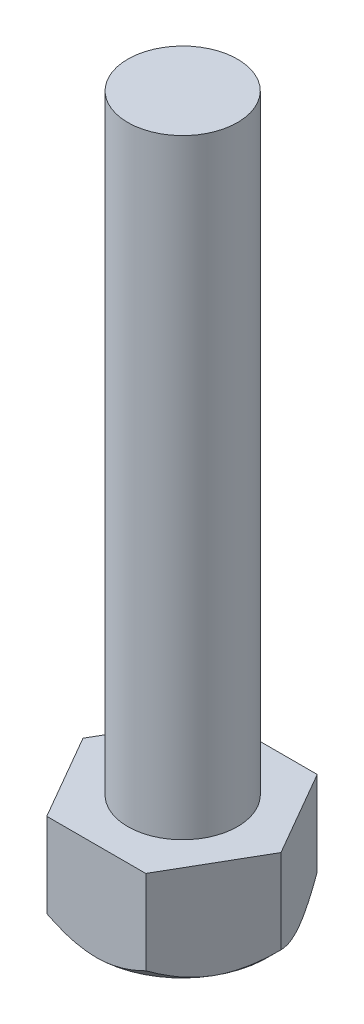
ISO-10303-21;
HEADER;
FILE_DESCRIPTION(('STEP AP214'),'2;1');
FILE_NAME('part.step','',(''),(''),'','','');
FILE_SCHEMA(('AUTOMOTIVE_DESIGN { 1 0 10303 214 1 1 1 1 }'));
ENDSEC;
DATA;
#1=APPLICATION_CONTEXT('core data for automotive mechanical design processes');
#2=APPLICATION_PROTOCOL_DEFINITION('international standard','automotive_design',2000,#1);
#3=PRODUCT_CONTEXT('',#1,'mechanical');
#4=PRODUCT('Part','Part','',(#3));
#5=PRODUCT_RELATED_PRODUCT_CATEGORY('part','',(#4));
#6=PRODUCT_DEFINITION_FORMATION('','',#4);
#7=PRODUCT_DEFINITION_CONTEXT('part definition',#1,'design');
#8=PRODUCT_DEFINITION('design','',#6,#7);
#9=PRODUCT_DEFINITION_SHAPE('','',#8);
#10=(LENGTH_UNIT() NAMED_UNIT(*) SI_UNIT(.MILLI.,.METRE.));
#11=(NAMED_UNIT(*) PLANE_ANGLE_UNIT() SI_UNIT($,.RADIAN.));
#12=(NAMED_UNIT(*) SI_UNIT($,.STERADIAN.) SOLID_ANGLE_UNIT());
#13=UNCERTAINTY_MEASURE_WITH_UNIT(LENGTH_MEASURE(1.E-05),#10,'distance_accuracy_value','');
#14=(GEOMETRIC_REPRESENTATION_CONTEXT(3) GLOBAL_UNCERTAINTY_ASSIGNED_CONTEXT((#13)) GLOBAL_UNIT_ASSIGNED_CONTEXT((#10,
#11,#12)) REPRESENTATION_CONTEXT('',''));
#15=CARTESIAN_POINT('',(0.,0.,0.));
#16=DIRECTION('',(0.,0.,1.));
#17=DIRECTION('',(1.,0.,0.));
#18=AXIS2_PLACEMENT_3D('',#15,#16,#17);
#19=CARTESIAN_POINT('',(4.27921462757046,-4.,-3.48744040404615));
#20=DIRECTION('',(-0.866025403784442,0.,0.499999999999995));
#21=DIRECTION('',(0.499999999999995,0.,0.866025403784442));
#22=AXIS2_PLACEMENT_3D('',#19,#20,#21);
#23=PLANE('',#22);
#24=CARTESIAN_POINT('',(4.27909915751662,-3.4561581042914,-3.48764040404615));
#25=CARTESIAN_POINT('',(4.3139924249868,-3.4910481287641,-3.42720349194571));
#26=CARTESIAN_POINT('',(4.34915270961407,-3.52486775848933,-3.36630409256269));
#27=CARTESIAN_POINT('',(4.42006231857277,-3.59003994533827,-3.24348504710137));
#28=CARTESIAN_POINT('',(4.45581195193069,-3.6213911549383,-3.1815648657735));
#29=CARTESIAN_POINT('',(4.56435957461921,-3.71152011698869,-2.99355486823617));
#30=CARTESIAN_POINT('',(4.63808012219458,-3.7659886432836,-2.86586713427382));
#31=CARTESIAN_POINT('',(4.78671469660377,-3.85926887906115,-2.60842449963572));
#32=CARTESIAN_POINT('',(4.86159117743718,-3.89831549549905,-2.4787346305403));
#33=CARTESIAN_POINT('',(5.01299756781424,-3.95848019383051,-2.21649106981663));
#34=CARTESIAN_POINT('',(5.08952284006868,-3.97964316534672,-2.08394541020889));
#35=CARTESIAN_POINT('',(5.22141043008999,-3.99873711003174,-1.85550940340417));
#36=CARTESIAN_POINT('',(5.27660281393376,-4.00156305918427,-1.75991339039592));
#37=CARTESIAN_POINT('',(5.38689800845522,-3.99679992966115,-1.56887650965404));
#38=CARTESIAN_POINT('',(5.44200078095368,-3.98920719989115,-1.47343570804881));
#39=CARTESIAN_POINT('',(5.55168422401849,-3.96403979479059,-1.28345841191146));
#40=CARTESIAN_POINT('',(5.60626424106714,-3.94645395472217,-1.18892304930523));
#41=CARTESIAN_POINT('',(5.71448689622081,-3.9022603097514,-1.00147591204907));
#42=CARTESIAN_POINT('',(5.76812960586287,-3.87565319655989,-0.908564013493352));
#43=CARTESIAN_POINT('',(5.86335970384695,-3.82091096312995,-0.743620645375156));
#44=CARTESIAN_POINT('',(5.90515790461734,-3.79421498343225,-0.671224037975873));
#45=CARTESIAN_POINT('',(5.98800392818275,-3.73652063473449,-0.527730515955535));
#46=CARTESIAN_POINT('',(6.02905172807927,-3.70552213469011,-0.456633640995842));
#47=CARTESIAN_POINT('',(6.11026762749963,-3.63991768689401,-0.315963576817376));
#48=CARTESIAN_POINT('',(6.15043803697813,-3.6053230828555,-0.246386386639762));
#49=CARTESIAN_POINT('',(6.23003492114266,-3.53298073619269,-0.108520539142619));
#50=CARTESIAN_POINT('',(6.26946183435644,-3.49523492836098,-0.040231122270739));
#51=CARTESIAN_POINT('',(6.30854472519467,-3.4561581042914,0.0274624303677426));
#52=B_SPLINE_CURVE_WITH_KNOTS('',3,(#24,#25,#26,#27,#28,#29,#30,#31,#32,#33,#34,#35,#36,#37,#38,
#39,#40,#41,#42,#43,#44,#45,#46,#47,#48,#49,#50,#51),.UNSPECIFIED.,.F.,.F.,(4,2,2,2,2,2,2,2,2,2,
2,2,2,4),(0.,0.234049102996292,0.468225101303026,0.939105698053542,1.4025082959921,
1.8647442254441,2.19553974875006,2.52645122477606,2.85773313845376,3.1889896566592,
3.45213283652283,3.7152840328478,3.97762897018194,4.23981399981549),.UNSPECIFIED.);
#53=CARTESIAN_POINT('',(4.27921462757046,-3.45627357927311,-3.48744040404615));
#54=VERTEX_POINT('',#53);
#55=CARTESIAN_POINT('',(5.29382194135565,-4.,-1.73008898683921));
#56=VERTEX_POINT('',#55);
#57=EDGE_CURVE('E119',#54,#56,#52,.T.);
#58=ORIENTED_EDGE('',*,*,#57,.F.);
#59=DIRECTION('',(0.,1.,0.));
#60=VECTOR('',#59,1.);
#61=CARTESIAN_POINT('',(4.27921462757046,-4.,-3.48744040404615));
#62=LINE('',#61,#60);
#63=CARTESIAN_POINT('',(4.27921462757046,0.,-3.48744040404615));
#64=VERTEX_POINT('',#63);
#65=EDGE_CURVE('E68',#54,#64,#62,.T.);
#66=ORIENTED_EDGE('',*,*,#65,.T.);
#67=DIRECTION('',(0.499999999999995,0.,0.866025403784442));
#68=VECTOR('',#67,1.);
#69=CARTESIAN_POINT('',(4.27921462757046,0.,-3.48744040404615));
#70=LINE('',#69,#68);
#71=CARTESIAN_POINT('',(6.30842925514083,0.,0.0272624303677429));
#72=VERTEX_POINT('',#71);
#73=EDGE_CURVE('E127',#64,#72,#70,.T.);
#74=ORIENTED_EDGE('',*,*,#73,.T.);
#75=DIRECTION('',(0.,1.,0.));
#76=VECTOR('',#75,1.);
#77=CARTESIAN_POINT('',(6.30842925514083,-4.,0.0272624303677429));
#78=LINE('',#77,#76);
#79=CARTESIAN_POINT('',(6.30842925514083,-3.45627357927311,0.027262430367743));
#80=VERTEX_POINT('',#79);
#81=EDGE_CURVE('E141',#80,#72,#78,.T.);
#82=ORIENTED_EDGE('',*,*,#81,.F.);
#83=EDGE_CURVE('E128',#56,#80,#52,.T.);
#84=ORIENTED_EDGE('',*,*,#83,.F.);
#85=EDGE_LOOP('',(#58,#66,#74,#82,#84));
#86=FACE_BOUND('',#85,.T.);
#87=ADVANCED_FACE('F44',(#86),#23,.F.);
#88=CARTESIAN_POINT('',(6.30842925514083,-4.,0.0272624303677429));
#89=DIRECTION('',(-0.866025403784438,0.,-0.500000000000001));
#90=DIRECTION('',(-0.500000000000001,0.,0.866025403784438));
#91=AXIS2_PLACEMENT_3D('',#88,#89,#90);
#92=PLANE('',#91);
#93=CARTESIAN_POINT('',(6.30854472519467,-3.45615810429139,0.0270624303677429));
#94=CARTESIAN_POINT('',(6.27365145772449,-3.4910481287641,0.0874993424681807));
#95=CARTESIAN_POINT('',(6.23849117309722,-3.52486775848932,0.148398741851203));
#96=CARTESIAN_POINT('',(6.16758156413851,-3.59003994533827,0.271217787312522));
#97=CARTESIAN_POINT('',(6.13183193078059,-3.62139115493829,0.333137968640396));
#98=CARTESIAN_POINT('',(6.02328430809208,-3.71152011698869,0.521147966177725));
#99=CARTESIAN_POINT('',(5.9495637605167,-3.7659886432836,0.648835700140078));
#100=CARTESIAN_POINT('',(5.8009291861075,-3.85926887906115,0.906278334778177));
#101=CARTESIAN_POINT('',(5.72605270527409,-3.89831549549906,1.0359682038736));
#102=CARTESIAN_POINT('',(5.57464631489704,-3.95848019383051,1.29821176459727));
#103=CARTESIAN_POINT('',(5.49812104264259,-3.97964316534673,1.43075742420501));
#104=CARTESIAN_POINT('',(5.36623345262128,-3.99873711003175,1.65919343100973));
#105=CARTESIAN_POINT('',(5.31104106877751,-4.00156305918428,1.75478944401799));
#106=CARTESIAN_POINT('',(5.20074587425604,-3.99679992966116,1.94582632475986));
#107=CARTESIAN_POINT('',(5.14564310175759,-3.98920719989116,2.04126712636509));
#108=CARTESIAN_POINT('',(5.03595965869277,-3.9640397947906,2.23124442250244));
#109=CARTESIAN_POINT('',(4.98137964164413,-3.94645395472218,2.32577978510867));
#110=CARTESIAN_POINT('',(4.87315698649046,-3.9022603097514,2.51322692236483));
#111=CARTESIAN_POINT('',(4.8195142768484,-3.8756531965599,2.60613882092055));
#112=CARTESIAN_POINT('',(4.72428417886431,-3.82091096312995,2.77108218903874));
#113=CARTESIAN_POINT('',(4.68248597809392,-3.79421498343225,2.84347879643803));
#114=CARTESIAN_POINT('',(4.59963995452851,-3.73652063473449,2.98697231845837));
#115=CARTESIAN_POINT('',(4.55859215463198,-3.70552213469011,3.05806919341807));
#116=CARTESIAN_POINT('',(4.47737625521162,-3.63991768689401,3.19873925759654));
#117=CARTESIAN_POINT('',(4.43720584573312,-3.6053230828555,3.26831644777415));
#118=CARTESIAN_POINT('',(4.35760896156858,-3.53298073619269,3.4061822952713));
#119=CARTESIAN_POINT('',(4.3181820483548,-3.49523492836097,3.47447171214318));
#120=CARTESIAN_POINT('',(4.27909915751657,-3.45615810429138,3.54216526478167));
#121=B_SPLINE_CURVE_WITH_KNOTS('',3,(#93,#94,#95,#96,#97,#98,#99,#100,#101,#102,#103,#104,#105,
#106,#107,#108,#109,#110,#111,#112,#113,#114,#115,#116,#117,#118,#119,#120),.UNSPECIFIED.,.F.,
.F.,(4,2,2,2,2,2,2,2,2,2,2,2,2,4),(0.,0.234049102996294,0.468225101303032,0.939105698053553,
1.40250829599211,1.86474422544412,2.19553974875008,2.52645122477608,2.85773313845378,
3.18898965665922,3.45213283652286,3.71528403284784,3.97762897018199,4.23981399981555),.UNSPECIFIED.);
#122=CARTESIAN_POINT('',(5.29382194135564,-4.,1.7846138475747));
#123=VERTEX_POINT('',#122);
#124=EDGE_CURVE('E133',#80,#123,#121,.T.);
#125=ORIENTED_EDGE('',*,*,#124,.F.);
#126=ORIENTED_EDGE('',*,*,#81,.T.);
#127=DIRECTION('',(-0.500000000000001,0.,0.866025403784438));
#128=VECTOR('',#127,1.);
#129=CARTESIAN_POINT('',(6.30842925514083,0.,0.0272624303677429));
#130=LINE('',#129,#128);
#131=CARTESIAN_POINT('',(4.27921462757041,0.,3.54196526478167));
#132=VERTEX_POINT('',#131);
#133=EDGE_CURVE('E272',#72,#132,#130,.T.);
#134=ORIENTED_EDGE('',*,*,#133,.T.);
#135=DIRECTION('',(0.,1.,0.));
#136=VECTOR('',#135,1.);
#137=CARTESIAN_POINT('',(4.27921462757041,-4.,3.54196526478167));
#138=LINE('',#137,#136);
#139=CARTESIAN_POINT('',(4.27921462757229,-3.45627357927317,3.54196526478167));
#140=VERTEX_POINT('',#139);
#141=EDGE_CURVE('E216',#140,#132,#138,.T.);
#142=ORIENTED_EDGE('',*,*,#141,.F.);
#143=EDGE_CURVE('E144',#123,#140,#121,.T.);
#144=ORIENTED_EDGE('',*,*,#143,.F.);
#145=EDGE_LOOP('',(#125,#126,#134,#142,#144));
#146=FACE_BOUND('',#145,.T.);
#147=ADVANCED_FACE('F204',(#146),#92,.F.);
#148=CARTESIAN_POINT('',(4.27921462757041,-4.,3.54196526478167));
#149=DIRECTION('',(0.,0.,-1.));
#150=DIRECTION('',(-1.,0.,0.));
#151=AXIS2_PLACEMENT_3D('',#148,#149,#150);
#152=PLANE('',#151);
#153=CARTESIAN_POINT('',(9.97773438158413,0.974762089039993,3.54196526478168));
#154=CARTESIAN_POINT('',(9.75138889710024,0.76878671703055,3.54196526478168));
#155=CARTESIAN_POINT('',(9.52432415351616,0.563591262338755,3.54196526478168));
#156=CARTESIAN_POINT('',(9.06815916876586,0.1553563194778,3.54196526478168));
#157=CARTESIAN_POINT('',(8.83905840856612,-0.047682588183733,3.54196526478168));
#158=CARTESIAN_POINT('',(8.37655382901964,-0.452465076797903,3.54196526478168));
#159=CARTESIAN_POINT('',(8.14313040943465,-0.654186353285388,3.54196526478168));
#160=CARTESIAN_POINT('',(7.79046588020397,-0.953752307130985,3.54196526478168));
#161=CARTESIAN_POINT('',(7.67249903542698,-1.05309711624209,3.54196526478168));
#162=CARTESIAN_POINT('',(7.43556503415039,-1.25060356775087,3.54196526478168));
#163=CARTESIAN_POINT('',(7.31659781065295,-1.34876512981478,3.54196526478168));
#164=CARTESIAN_POINT('',(6.99129657590863,-1.61395923069224,3.54196526478167));
#165=CARTESIAN_POINT('',(6.7838291521901,-1.77960725183168,3.54196526478167));
#166=CARTESIAN_POINT('',(6.36439184312241,-2.10510145246806,3.54196526478167));
#167=CARTESIAN_POINT('',(6.15242252513054,-2.26494835626122,3.54196526478167));
#168=CARTESIAN_POINT('',(5.83003034925145,-2.49829813320451,3.54196526478167));
#169=CARTESIAN_POINT('',(5.72189802585617,-2.57496373722791,3.54196526478167));
#170=CARTESIAN_POINT('',(5.50384995442899,-2.72570974529951,3.54196526478167));
#171=CARTESIAN_POINT('',(5.39393431775866,-2.79979030987091,3.54196526478167));
#172=CARTESIAN_POINT('',(5.1720754518299,-2.94473417621715,3.54196526478167));
#173=CARTESIAN_POINT('',(5.0601333271387,-3.01559916096744,3.54196526478167));
#174=CARTESIAN_POINT('',(4.83384255152369,-3.15335957576722,3.54196526478167));
#175=CARTESIAN_POINT('',(4.71949418478114,-3.22025547104805,3.54196526478167));
#176=CARTESIAN_POINT('',(4.49198277034389,-3.34684864810079,3.54196526478167));
#177=CARTESIAN_POINT('',(4.3789148578918,-3.40671463052772,3.54196526478167));
#178=CARTESIAN_POINT('',(4.14990195961647,-3.52059816042015,3.54196526478166));
#179=CARTESIAN_POINT('',(4.03395672039591,-3.57461519052362,3.54196526478166));
#180=CARTESIAN_POINT('',(3.68163806945086,-3.72552773791813,3.54196526478166));
#181=CARTESIAN_POINT('',(3.4402070144533,-3.81162103023786,3.54196526478166));
#182=CARTESIAN_POINT('',(3.09224332488991,-3.90180893292847,3.54196526478166));
#183=CARTESIAN_POINT('',(2.99039406821235,-3.92428335014399,3.54196526478166));
#184=CARTESIAN_POINT('',(2.78519074781842,-3.9609176270946,3.54196526478166));
#185=CARTESIAN_POINT('',(2.68183690257531,-3.97507868186792,3.54196526478166));
#186=CARTESIAN_POINT('',(2.47447777245681,-3.9943487320834,3.54196526478166));
#187=CARTESIAN_POINT('',(2.37047409882735,-3.99947487879169,3.54196526478166));
#188=CARTESIAN_POINT('',(2.16241988105922,-4.00044815822765,3.54196526478166));
#189=CARTESIAN_POINT('',(2.05836933618909,-3.99629514075006,3.54196526478166));
#190=CARTESIAN_POINT('',(1.85133134944199,-3.97896300453721,3.54196526478166));
#191=CARTESIAN_POINT('',(1.74834173385255,-3.96580943358625,3.54196526478166));
#192=CARTESIAN_POINT('',(1.54376890159996,-3.93116742247749,3.54196526478166));
#193=CARTESIAN_POINT('',(1.4421860279859,-3.90967698510487,3.54196526478166));
#194=CARTESIAN_POINT('',(1.2406329836212,-3.85924035989999,3.54196526478166));
#195=CARTESIAN_POINT('',(1.14066763345222,-3.83027513556229,3.54196526478165));
#196=CARTESIAN_POINT('',(0.942842035973081,-3.76596367304392,3.54196526478165));
#197=CARTESIAN_POINT('',(0.84498166925315,-3.73061779789364,3.54196526478165));
#198=CARTESIAN_POINT('',(0.614546159369927,-3.64007651954844,3.54196526478165));
#199=CARTESIAN_POINT('',(0.482931245706683,-3.58244592464755,3.54196526478165));
#200=CARTESIAN_POINT('',(0.22345843601654,-3.4592176794194,3.54196526478165));
#201=CARTESIAN_POINT('',(0.0956026123090181,-3.39361573324528,3.54196526478165));
#202=CARTESIAN_POINT('',(-0.157005324314549,-3.25611579395527,3.54196526478165));
#203=CARTESIAN_POINT('',(-0.281750233281364,-3.18420466649321,3.54196526478165));
#204=CARTESIAN_POINT('',(-0.528302598983671,-3.03559232002085,3.54196526478165));
#205=CARTESIAN_POINT('',(-0.650110577535404,-2.95889196075642,3.54196526478165));
#206=CARTESIAN_POINT('',(-0.892525391211597,-2.80088628044549,3.54196526478165));
#207=CARTESIAN_POINT('',(-1.01310600857498,-2.71954092336777,3.54196526478165));
#208=CARTESIAN_POINT('',(-1.25214535583716,-2.55378099836699,3.54196526478165));
#209=CARTESIAN_POINT('',(-1.37060390964468,-2.46936617748114,3.54196526478165));
#210=CARTESIAN_POINT('',(-1.60557422032815,-2.29817886716371,3.54196526478165));
#211=CARTESIAN_POINT('',(-1.72208821772433,-2.21140944445249,3.54196526478165));
#212=CARTESIAN_POINT('',(-1.95359642308834,-2.03586455188503,3.54196526478164));
#213=CARTESIAN_POINT('',(-2.06859058952387,-1.9470890273871,3.54196526478164));
#214=CARTESIAN_POINT('',(-2.32763946569296,-1.74410283291182,3.54196526478164));
#215=CARTESIAN_POINT('',(-2.47130505454393,-1.62939607773928,3.54196526478164));
#216=CARTESIAN_POINT('',(-2.75693065743054,-1.3978800248359,3.54196526478164));
#217=CARTESIAN_POINT('',(-2.89889064545649,-1.2810706951094,3.54196526478164));
#218=CARTESIAN_POINT('',(-3.32278583899918,-0.928014111959058,3.54196526478164));
#219=CARTESIAN_POINT('',(-3.60261254675422,-0.689236411326527,3.54196526478164));
#220=CARTESIAN_POINT('',(-4.14987055114183,-0.214452958210744,3.54196526478164));
#221=CARTESIAN_POINT('',(-4.41742032223653,0.0214170519593392,3.54196526478164));
#222=CARTESIAN_POINT('',(-4.81657984519698,0.377451123576966,3.54196526478164));
#223=CARTESIAN_POINT('',(-4.94922473812871,0.496457356631139,3.54196526478163));
#224=CARTESIAN_POINT('',(-5.21391039757361,0.735135592825062,3.54196526478163));
#225=CARTESIAN_POINT('',(-5.34595117393441,0.85480758504138,3.54196526478163));
#226=CARTESIAN_POINT('',(-5.47773438158416,0.974762089040004,3.54196526478163));
#227=B_SPLINE_CURVE_WITH_KNOTS('',3,(#153,#154,#155,#156,#157,#158,#159,#160,#161,#162,#163,
#164,#165,#166,#167,#168,#169,#170,#171,#172,#173,#174,#175,#176,#177,#178,#179,#180,#181,#182,
#183,#184,#185,#186,#187,#188,#189,#190,#191,#192,#193,#194,#195,#196,#197,#198,#199,#200,#201,
#202,#203,#204,#205,#206,#207,#208,#209,#210,#211,#212,#213,#214,#215,#216,#217,#218,#219,#220,
#221,#222,#223,#224,#225,#226),.UNSPECIFIED.,.F.,.F.,(4,2,2,2,2,2,2,2,2,2,2,2,2,2,2,2,2,2,2,2,2,
2,2,2,2,2,2,2,2,2,2,2,2,2,2,2,4),(0.,0.918116662716448,1.83647450430518,2.7619642154415,
3.22463484437831,3.68733671029699,4.48372355779257,5.28001062822671,5.67763966544688,
6.07524396699374,6.47263771112092,6.86998478289315,7.25362779038036,7.6373047048742,
8.40266953432452,8.71529178200707,9.02786907951715,9.33985235945528,9.65184068961882,
9.96294710443211,10.2741280952785,10.5861095486335,10.8980732572357,11.3287466390254,
11.7596531533523,12.1914790309661,12.623227610368,13.0595297822834,13.4958679928962,
13.9316628642296,14.3674696199733,14.9189657386917,15.4704702568414,16.5739529358047,
17.6439517482697,18.1785658608421,18.7131712274615),.UNSPECIFIED.);
#228=CARTESIAN_POINT('',(2.24999999999999,-4.,3.54196526478167));
#229=VERTEX_POINT('',#228);
#230=EDGE_CURVE('E198',#140,#229,#227,.T.);
#231=ORIENTED_EDGE('',*,*,#230,.F.);
#232=ORIENTED_EDGE('',*,*,#141,.T.);
#233=DIRECTION('',(-1.,0.,0.));
#234=VECTOR('',#233,1.);
#235=CARTESIAN_POINT('',(4.27921462757041,0.,3.54196526478167));
#236=LINE('',#235,#234);
#237=CARTESIAN_POINT('',(0.220785372429568,0.,3.54196526478165));
#238=VERTEX_POINT('',#237);
#239=EDGE_CURVE('E238',#132,#238,#236,.T.);
#240=ORIENTED_EDGE('',*,*,#239,.T.);
#241=DIRECTION('',(0.,1.,0.));
#242=VECTOR('',#241,1.);
#243=CARTESIAN_POINT('',(0.220785372429568,-4.,3.54196526478165));
#244=LINE('',#243,#242);
#245=CARTESIAN_POINT('',(0.220785372429568,-3.45627357927309,3.54196526478165));
#246=VERTEX_POINT('',#245);
#247=EDGE_CURVE('E236',#246,#238,#244,.T.);
#248=ORIENTED_EDGE('',*,*,#247,.F.);
#249=EDGE_CURVE('E191',#229,#246,#227,.T.);
#250=ORIENTED_EDGE('',*,*,#249,.F.);
#251=EDGE_LOOP('',(#231,#232,#240,#248,#250));
#252=FACE_BOUND('',#251,.T.);
#253=ADVANCED_FACE('F200',(#252),#152,.F.);
#254=CARTESIAN_POINT('',(0.220785372429568,-4.,3.54196526478165));
#255=DIRECTION('',(0.866025403784441,0.,-0.499999999999995));
#256=DIRECTION('',(-0.499999999999995,0.,-0.866025403784442));
#257=AXIS2_PLACEMENT_3D('',#254,#255,#256);
#258=PLANE('',#257);
#259=CARTESIAN_POINT('',(0.220900842483406,-3.45615810429138,3.54216526478165));
#260=CARTESIAN_POINT('',(0.186007575013229,-3.49104812876408,3.48172835268121));
#261=CARTESIAN_POINT('',(0.150847290385954,-3.52486775848931,3.42082895329819));
#262=CARTESIAN_POINT('',(0.0799376814272493,-3.59003994533825,3.29800990783687));
#263=CARTESIAN_POINT('',(0.0441880480693308,-3.62139115493828,3.236089726509));
#264=CARTESIAN_POINT('',(-0.0643595746191864,-3.71152011698868,3.04807972897167));
#265=CARTESIAN_POINT('',(-0.138080122194564,-3.76598864328358,2.92039199500931));
#266=CARTESIAN_POINT('',(-0.286714696603757,-3.85926887906114,2.66294936037121));
#267=CARTESIAN_POINT('',(-0.361591177437167,-3.89831549549904,2.53325949127578));
#268=CARTESIAN_POINT('',(-0.512997567814224,-3.9584801938305,2.27101593055211));
#269=CARTESIAN_POINT('',(-0.589522840068666,-3.97964316534672,2.13847027094437));
#270=CARTESIAN_POINT('',(-0.721410430089976,-3.99873711003174,1.91003426413965));
#271=CARTESIAN_POINT('',(-0.776602813933746,-4.00156305918426,1.81443825113139));
#272=CARTESIAN_POINT('',(-0.886898008455212,-3.99679992966114,1.62340137038952));
#273=CARTESIAN_POINT('',(-0.942000780953667,-3.98920719989115,1.52796056878428));
#274=CARTESIAN_POINT('',(-1.05168422401848,-3.96403979479059,1.33798327264693));
#275=CARTESIAN_POINT('',(-1.10626424106713,-3.94645395472217,1.2434479100407));
#276=CARTESIAN_POINT('',(-1.2144868962208,-3.90226030975139,1.05600077278454));
#277=CARTESIAN_POINT('',(-1.26812960586286,-3.87565319655989,0.963088874228825));
#278=CARTESIAN_POINT('',(-1.36335970384694,-3.82091096312994,0.798145506110628));
#279=CARTESIAN_POINT('',(-1.40515790461733,-3.79421498343225,0.725748898711344));
#280=CARTESIAN_POINT('',(-1.48800392818274,-3.73652063473448,0.582255376691002));
#281=CARTESIAN_POINT('',(-1.52905172807926,-3.7055221346901,0.511158501731308));
#282=CARTESIAN_POINT('',(-1.61026762749962,-3.639917686894,0.37048843755284));
#283=CARTESIAN_POINT('',(-1.65043803697813,-3.60532308285549,0.300911247375224));
#284=CARTESIAN_POINT('',(-1.73003492114266,-3.53298073619268,0.163045399878079));
#285=CARTESIAN_POINT('',(-1.76946183435644,-3.49523492836096,0.0947559830061977));
#286=CARTESIAN_POINT('',(-1.80854472519467,-3.45615810429138,0.0270624303677146));
#287=B_SPLINE_CURVE_WITH_KNOTS('',3,(#259,#260,#261,#262,#263,#264,#265,#266,#267,#268,#269,
#270,#271,#272,#273,#274,#275,#276,#277,#278,#279,#280,#281,#282,#283,#284,#285,#286),
.UNSPECIFIED.,.F.,.F.,(4,2,2,2,2,2,2,2,2,2,2,2,2,4),(0.,0.234049102996295,0.468225101303034,
0.939105698053559,1.40250829599212,1.86474422544413,2.19553974875009,2.52645122477609,
2.85773313845379,3.18898965665923,3.45213283652287,3.71528403284784,3.97762897018199,
4.23981399981555),.UNSPECIFIED.);
#288=CARTESIAN_POINT('',(-0.79382194135564,-4.,1.78461384757468));
#289=VERTEX_POINT('',#288);
#290=EDGE_CURVE('E199',#246,#289,#287,.T.);
#291=ORIENTED_EDGE('',*,*,#290,.F.);
#292=ORIENTED_EDGE('',*,*,#247,.T.);
#293=DIRECTION('',(-0.499999999999995,0.,-0.866025403784442));
#294=VECTOR('',#293,1.);
#295=CARTESIAN_POINT('',(0.220785372429568,0.,3.54196526478165));
#296=LINE('',#295,#294);
#297=CARTESIAN_POINT('',(-1.80842925514083,0.,0.0272624303677145));
#298=VERTEX_POINT('',#297);
#299=EDGE_CURVE('E276',#238,#298,#296,.T.);
#300=ORIENTED_EDGE('',*,*,#299,.T.);
#301=DIRECTION('',(0.,1.,0.));
#302=VECTOR('',#301,1.);
#303=CARTESIAN_POINT('',(-1.80842925514083,-4.,0.0272624303677145));
#304=LINE('',#303,#302);
#305=CARTESIAN_POINT('',(-1.80842925514083,-3.4562735792731,0.0272624303677142));
#306=VERTEX_POINT('',#305);
#307=EDGE_CURVE('E243',#306,#298,#304,.T.);
#308=ORIENTED_EDGE('',*,*,#307,.F.);
#309=EDGE_CURVE('E185',#289,#306,#287,.T.);
#310=ORIENTED_EDGE('',*,*,#309,.F.);
#311=EDGE_LOOP('',(#291,#292,#300,#308,#310));
#312=FACE_BOUND('',#311,.T.);
#313=ADVANCED_FACE('F203',(#312),#258,.F.);
#314=CARTESIAN_POINT('',(-1.80842925514083,-4.,0.0272624303677145));
#315=DIRECTION('',(0.866025403784435,0.,0.500000000000007));
#316=DIRECTION('',(0.500000000000007,0.,-0.866025403784435));
#317=AXIS2_PLACEMENT_3D('',#314,#315,#316);
#318=PLANE('',#317);
#319=CARTESIAN_POINT('',(-1.80854472519467,-3.45615810429138,0.0274624303677144));
#320=CARTESIAN_POINT('',(-1.77365145772449,-3.49104812876408,-0.0329744817327233));
#321=CARTESIAN_POINT('',(-1.73849117309722,-3.52486775848931,-0.0938738811157463));
#322=CARTESIAN_POINT('',(-1.66758156413851,-3.59003994533826,-0.216692926577066));
#323=CARTESIAN_POINT('',(-1.63183193078059,-3.62139115493829,-0.27861310790494));
#324=CARTESIAN_POINT('',(-1.52328430809207,-3.71152011698868,-0.46662310544227));
#325=CARTESIAN_POINT('',(-1.44956376051669,-3.76598864328359,-0.594310839404623));
#326=CARTESIAN_POINT('',(-1.30092918610749,-3.85926887906115,-0.851753474042725));
#327=CARTESIAN_POINT('',(-1.22605270527408,-3.89831549549905,-0.98144334313815));
#328=CARTESIAN_POINT('',(-1.07464631489702,-3.95848019383051,-1.24368690386182));
#329=CARTESIAN_POINT('',(-0.998121042642575,-3.97964316534673,-1.37623256346956));
#330=CARTESIAN_POINT('',(-0.866233452621262,-3.99873711003174,-1.60466857027428));
#331=CARTESIAN_POINT('',(-0.81104106877749,-4.00156305918427,-1.70026458328254));
#332=CARTESIAN_POINT('',(-0.700745874256023,-3.99679992966115,-1.89130146402441));
#333=CARTESIAN_POINT('',(-0.645643101757566,-3.98920719989116,-1.98674226562964));
#334=CARTESIAN_POINT('',(-0.535959658692748,-3.9640397947906,-2.17671956176699));
#335=CARTESIAN_POINT('',(-0.481379641644102,-3.94645395472218,-2.27125492437322));
#336=CARTESIAN_POINT('',(-0.37315698649043,-3.9022603097514,-2.45870206162938));
#337=CARTESIAN_POINT('',(-0.319514276848369,-3.8756531965599,-2.5516139601851));
#338=CARTESIAN_POINT('',(-0.224284178864283,-3.82091096312995,-2.71655732830329));
#339=CARTESIAN_POINT('',(-0.182485978093891,-3.79421498343225,-2.78895393570257));
#340=CARTESIAN_POINT('',(-0.0996399545284783,-3.73652063473449,-2.93244745772291));
#341=CARTESIAN_POINT('',(-0.0585921546319573,-3.70552213469011,-3.00354433268261));
#342=CARTESIAN_POINT('',(0.0226237447884033,-3.63991768689401,-3.14421439686107));
#343=CARTESIAN_POINT('',(0.0627941542669078,-3.6053230828555,-3.21379158703869));
#344=CARTESIAN_POINT('',(0.142391038431441,-3.53298073619269,-3.35165743453583));
#345=CARTESIAN_POINT('',(0.181817951645224,-3.49523492836097,-3.41994685140771));
#346=CARTESIAN_POINT('',(0.220900842483455,-3.45615810429139,-3.48764040404619));
#347=B_SPLINE_CURVE_WITH_KNOTS('',3,(#319,#320,#321,#322,#323,#324,#325,#326,#327,#328,#329,
#330,#331,#332,#333,#334,#335,#336,#337,#338,#339,#340,#341,#342,#343,#344,#345,#346),
.UNSPECIFIED.,.F.,.F.,(4,2,2,2,2,2,2,2,2,2,2,2,2,4),(0.,0.234049102996296,0.468225101303036,
0.939105698053562,1.40250829599213,1.86474422544414,2.1955397487501,2.5264512247761,
2.8577331384538,3.18898965665924,3.45213283652287,3.71528403284785,3.97762897018199,
4.23981399981555),.UNSPECIFIED.);
#348=CARTESIAN_POINT('',(-0.793821941355616,-4.,-1.73008898683926));
#349=VERTEX_POINT('',#348);
#350=EDGE_CURVE('E301',#306,#349,#347,.T.);
#351=ORIENTED_EDGE('',*,*,#350,.F.);
#352=ORIENTED_EDGE('',*,*,#307,.T.);
#353=DIRECTION('',(0.500000000000007,0.,-0.866025403784435));
#354=VECTOR('',#353,1.);
#355=CARTESIAN_POINT('',(-1.80842925514083,0.,0.0272624303677145));
#356=LINE('',#355,#354);
#357=CARTESIAN_POINT('',(0.220785372429616,0.,-3.48744040404619));
#358=VERTEX_POINT('',#357);
#359=EDGE_CURVE('E281',#298,#358,#356,.T.);
#360=ORIENTED_EDGE('',*,*,#359,.T.);
#361=DIRECTION('',(0.,1.,0.));
#362=VECTOR('',#361,1.);
#363=CARTESIAN_POINT('',(0.220785372429616,-4.,-3.48744040404619));
#364=LINE('',#363,#362);
#365=CARTESIAN_POINT('',(0.220785372427738,-3.45627357927318,-3.48744040404619));
#366=VERTEX_POINT('',#365);
#367=EDGE_CURVE('E248',#366,#358,#364,.T.);
#368=ORIENTED_EDGE('',*,*,#367,.F.);
#369=EDGE_CURVE('E178',#349,#366,#347,.T.);
#370=ORIENTED_EDGE('',*,*,#369,.F.);
#371=EDGE_LOOP('',(#351,#352,#360,#368,#370));
#372=FACE_BOUND('',#371,.T.);
#373=ADVANCED_FACE('F297',(#372),#318,.F.);
#374=CARTESIAN_POINT('',(0.220785372429616,-4.,-3.48744040404619));
#375=DIRECTION('',(0.,0.,1.));
#376=DIRECTION('',(1.,0.,0.));
#377=AXIS2_PLACEMENT_3D('',#374,#375,#376);
#378=PLANE('',#377);
#379=CARTESIAN_POINT('',(-5.47773438158411,0.974762089039998,-3.48744040404625));
#380=CARTESIAN_POINT('',(-5.25138889710021,0.768786717030556,-3.48744040404625));
#381=CARTESIAN_POINT('',(-5.02432415351613,0.56359126233876,-3.48744040404625));
#382=CARTESIAN_POINT('',(-4.56815916876584,0.155356319477802,-3.48744040404624));
#383=CARTESIAN_POINT('',(-4.33905840856609,-0.0476825881837328,-3.48744040404624));
#384=CARTESIAN_POINT('',(-3.87655382901961,-0.452465076797904,-3.48744040404624));
#385=CARTESIAN_POINT('',(-3.64313040943462,-0.65418635328539,-3.48744040404623));
#386=CARTESIAN_POINT('',(-3.29046588020394,-0.953752307130988,-3.48744040404623));
#387=CARTESIAN_POINT('',(-3.17249903542695,-1.05309711624209,-3.48744040404623));
#388=CARTESIAN_POINT('',(-2.93556503415036,-1.25060356775087,-3.48744040404623));
#389=CARTESIAN_POINT('',(-2.81659781065292,-1.34876512981478,-3.48744040404623));
#390=CARTESIAN_POINT('',(-2.49129657590859,-1.61395923069224,-3.48744040404622));
#391=CARTESIAN_POINT('',(-2.28382915219007,-1.77960725183169,-3.48744040404622));
#392=CARTESIAN_POINT('',(-1.86439184312238,-2.10510145246807,-3.48744040404622));
#393=CARTESIAN_POINT('',(-1.65242252513051,-2.26494835626122,-3.48744040404621));
#394=CARTESIAN_POINT('',(-1.33003034925141,-2.49829813320452,-3.48744040404621));
#395=CARTESIAN_POINT('',(-1.22189802585614,-2.57496373722792,-3.48744040404621));
#396=CARTESIAN_POINT('',(-1.00384995442896,-2.72570974529951,-3.48744040404621));
#397=CARTESIAN_POINT('',(-0.89393431775863,-2.79979030987092,-3.48744040404621));
#398=CARTESIAN_POINT('',(-0.67207545182987,-2.94473417621716,-3.4874404040462));
#399=CARTESIAN_POINT('',(-0.560133327138674,-3.01559916096744,-3.4874404040462));
#400=CARTESIAN_POINT('',(-0.333842551523663,-3.15335957576723,-3.4874404040462));
#401=CARTESIAN_POINT('',(-0.21949418478111,-3.22025547104806,-3.4874404040462));
#402=CARTESIAN_POINT('',(0.0080172296561414,-3.3468486481008,-3.4874404040462));
#403=CARTESIAN_POINT('',(0.12108514210823,-3.40671463052773,-3.4874404040462));
#404=CARTESIAN_POINT('',(0.350098040383561,-3.52059816042016,-3.48744040404619));
#405=CARTESIAN_POINT('',(0.466043279604119,-3.57461519052363,-3.48744040404619));
#406=CARTESIAN_POINT('',(0.81836193054917,-3.72552773791814,-3.48744040404619));
#407=CARTESIAN_POINT('',(1.05979298554673,-3.81162103023787,-3.48744040404618));
#408=CARTESIAN_POINT('',(1.40775667511011,-3.90180893292848,-3.48744040404618));
#409=CARTESIAN_POINT('',(1.50960593178768,-3.92428335014401,-3.48744040404618));
#410=CARTESIAN_POINT('',(1.7148092521816,-3.96091762709462,-3.48744040404618));
#411=CARTESIAN_POINT('',(1.81816309742471,-3.97507868186794,-3.48744040404618));
#412=CARTESIAN_POINT('',(2.02552222754321,-3.99434873208341,-3.48744040404617));
#413=CARTESIAN_POINT('',(2.12952590117267,-3.99947487879171,-3.48744040404617));
#414=CARTESIAN_POINT('',(2.3375801189408,-4.00044815822767,-3.48744040404617));
#415=CARTESIAN_POINT('',(2.44163066381093,-3.99629514075008,-3.48744040404617));
#416=CARTESIAN_POINT('',(2.64866865055803,-3.97896300453723,-3.48744040404617));
#417=CARTESIAN_POINT('',(2.75165826614746,-3.96580943358627,-3.48744040404617));
#418=CARTESIAN_POINT('',(2.95623109840006,-3.93116742247751,-3.48744040404616));
#419=CARTESIAN_POINT('',(3.05781397201411,-3.90967698510489,-3.48744040404616));
#420=CARTESIAN_POINT('',(3.25936701637882,-3.85924035990001,-3.48744040404616));
#421=CARTESIAN_POINT('',(3.3593323665478,-3.83027513556231,-3.48744040404616));
#422=CARTESIAN_POINT('',(3.55715796402693,-3.76596367304394,-3.48744040404616));
#423=CARTESIAN_POINT('',(3.65501833074687,-3.73061779789366,-3.48744040404616));
#424=CARTESIAN_POINT('',(3.88545384063009,-3.64007651954846,-3.48744040404616));
#425=CARTESIAN_POINT('',(4.01706875429333,-3.58244592464758,-3.48744040404615));
#426=CARTESIAN_POINT('',(4.27654156398347,-3.45921767941943,-3.48744040404615));
#427=CARTESIAN_POINT('',(4.40439738769099,-3.39361573324531,-3.48744040404615));
#428=CARTESIAN_POINT('',(4.65700532431455,-3.2561157939553,-3.48744040404615));
#429=CARTESIAN_POINT('',(4.78175023328136,-3.18420466649325,-3.48744040404615));
#430=CARTESIAN_POINT('',(5.02830259898367,-3.03559232002089,-3.48744040404614));
#431=CARTESIAN_POINT('',(5.1501105775354,-2.95889196075646,-3.48744040404614));
#432=CARTESIAN_POINT('',(5.39252539121158,-2.80088628044554,-3.48744040404614));
#433=CARTESIAN_POINT('',(5.51310600857497,-2.71954092336782,-3.48744040404614));
#434=CARTESIAN_POINT('',(5.75214535583715,-2.55378099836704,-3.48744040404614));
#435=CARTESIAN_POINT('',(5.87060390964466,-2.4693661774812,-3.48744040404613));
#436=CARTESIAN_POINT('',(6.10557422032812,-2.29817886716376,-3.48744040404613));
#437=CARTESIAN_POINT('',(6.2220882177243,-2.21140944445255,-3.48744040404613));
#438=CARTESIAN_POINT('',(6.45359642308831,-2.03586455188509,-3.48744040404613));
#439=CARTESIAN_POINT('',(6.56859058952385,-1.94708902738716,-3.48744040404613));
#440=CARTESIAN_POINT('',(6.82763946569293,-1.74410283291189,-3.48744040404612));
#441=CARTESIAN_POINT('',(6.97130505454391,-1.62939607773934,-3.48744040404612));
#442=CARTESIAN_POINT('',(7.25693065743052,-1.39788002483596,-3.48744040404612));
#443=CARTESIAN_POINT('',(7.39889064545648,-1.28107069510946,-3.48744040404612));
#444=CARTESIAN_POINT('',(7.82278583899917,-0.928014111959107,-3.48744040404611));
#445=CARTESIAN_POINT('',(8.10261254675422,-0.689236411326571,-3.48744040404611));
#446=CARTESIAN_POINT('',(8.64987055114184,-0.214452958210781,-3.48744040404611));
#447=CARTESIAN_POINT('',(8.91742032223654,0.0214170519593062,-3.4874404040461));
#448=CARTESIAN_POINT('',(9.31657984519699,0.37745112357694,-3.4874404040461));
#449=CARTESIAN_POINT('',(9.44922473812873,0.496457356631116,-3.4874404040461));
#450=CARTESIAN_POINT('',(9.71391039757363,0.735135592825043,-3.48744040404609));
#451=CARTESIAN_POINT('',(9.84595117393443,0.854807585041362,-3.48744040404609));
#452=CARTESIAN_POINT('',(9.97773438158418,0.974762089039988,-3.48744040404609));
#453=B_SPLINE_CURVE_WITH_KNOTS('',3,(#379,#380,#381,#382,#383,#384,#385,#386,#387,#388,#389,
#390,#391,#392,#393,#394,#395,#396,#397,#398,#399,#400,#401,#402,#403,#404,#405,#406,#407,#408,
#409,#410,#411,#412,#413,#414,#415,#416,#417,#418,#419,#420,#421,#422,#423,#424,#425,#426,#427,
#428,#429,#430,#431,#432,#433,#434,#435,#436,#437,#438,#439,#440,#441,#442,#443,#444,#445,#446,
#447,#448,#449,#450,#451,#452),.UNSPECIFIED.,.F.,.F.,(4,2,2,2,2,2,2,2,2,2,2,2,2,2,2,2,2,2,2,2,2,
2,2,2,2,2,2,2,2,2,2,2,2,2,2,2,4),(0.,0.918116662716451,1.83647450430519,2.76196421544151,
3.22463484437832,3.687336710297,4.48372355779258,5.28001062822672,5.67763966544689,
6.07524396699375,6.47263771112093,6.86998478289316,7.25362779038037,7.63730470487421,
8.40266953432453,8.71529178200707,9.02786907951716,9.33985235945528,9.65184068961883,
9.96294710443212,10.2741280952785,10.5861095486335,10.8980732572357,11.3287466390254,
11.7596531533522,12.191479030966,12.623227610368,13.0595297822834,13.4958679928962,
13.9316628642296,14.3674696199732,14.9189657386916,15.4704702568414,16.5739529358047,
17.6439517482697,18.1785658608421,18.7131712274615),.UNSPECIFIED.);
#454=CARTESIAN_POINT('',(2.25000000000004,-4.,-3.48744040404617));
#455=VERTEX_POINT('',#454);
#456=EDGE_CURVE('E293',#366,#455,#453,.T.);
#457=ORIENTED_EDGE('',*,*,#456,.F.);
#458=ORIENTED_EDGE('',*,*,#367,.T.);
#459=DIRECTION('',(1.,0.,0.));
#460=VECTOR('',#459,1.);
#461=CARTESIAN_POINT('',(0.220785372429616,0.,-3.48744040404619));
#462=LINE('',#461,#460);
#463=EDGE_CURVE('E271',#358,#64,#462,.T.);
#464=ORIENTED_EDGE('',*,*,#463,.T.);
#465=ORIENTED_EDGE('',*,*,#65,.F.);
#466=EDGE_CURVE('E124',#455,#54,#453,.T.);
#467=ORIENTED_EDGE('',*,*,#466,.F.);
#468=EDGE_LOOP('',(#457,#458,#464,#465,#467));
#469=FACE_BOUND('',#468,.T.);
#470=ADVANCED_FACE('F292',(#469),#378,.F.);
#471=CARTESIAN_POINT('',(2.25,25.,0.));
#472=DIRECTION('',(0.,1.,0.));
#473=DIRECTION('',(0.,0.,1.));
#474=AXIS2_PLACEMENT_3D('',#471,#472,#473);
#475=CYLINDRICAL_SURFACE('',#474,2.25);
#476=CARTESIAN_POINT('',(2.25,0.,0.));
#477=DIRECTION('',(0.,1.,0.));
#478=DIRECTION('',(0.,0.,1.));
#479=AXIS2_PLACEMENT_3D('',#476,#477,#478);
#480=CIRCLE('',#479,2.25);
#481=CARTESIAN_POINT('',(2.25,0.,2.25));
#482=VERTEX_POINT('',#481);
#483=EDGE_CURVE('E254',#482,#482,#480,.T.);
#484=ORIENTED_EDGE('',*,*,#483,.T.);
#485=EDGE_LOOP('',(#484));
#486=FACE_BOUND('',#485,.T.);
#487=CARTESIAN_POINT('',(2.25,25.,0.));
#488=DIRECTION('',(0.,1.,0.));
#489=DIRECTION('',(0.,0.,1.));
#490=AXIS2_PLACEMENT_3D('',#487,#488,#489);
#491=CIRCLE('',#490,2.25);
#492=CARTESIAN_POINT('',(2.25,25.,2.25));
#493=VERTEX_POINT('',#492);
#494=EDGE_CURVE('E255',#493,#493,#491,.T.);
#495=ORIENTED_EDGE('',*,*,#494,.F.);
#496=EDGE_LOOP('',(#495));
#497=FACE_BOUND('',#496,.T.);
#498=ADVANCED_FACE('F46',(#486,#497),#475,.T.);
#499=CARTESIAN_POINT('',(0.,25.,0.));
#500=DIRECTION('',(0.,1.,0.));
#501=DIRECTION('',(0.,0.,1.));
#502=AXIS2_PLACEMENT_3D('',#499,#500,#501);
#503=PLANE('',#502);
#504=ORIENTED_EDGE('',*,*,#494,.T.);
#505=EDGE_LOOP('',(#504));
#506=FACE_BOUND('',#505,.T.);
#507=ADVANCED_FACE('F267',(#506),#503,.T.);
#508=CARTESIAN_POINT('',(0.,0.,0.));
#509=DIRECTION('',(0.,-1.,0.));
#510=DIRECTION('',(0.,0.,-1.));
#511=AXIS2_PLACEMENT_3D('',#508,#509,#510);
#512=PLANE('',#511);
#513=ORIENTED_EDGE('',*,*,#483,.F.);
#514=EDGE_LOOP('',(#513));
#515=FACE_BOUND('',#514,.T.);
#516=ORIENTED_EDGE('',*,*,#73,.F.);
#517=ORIENTED_EDGE('',*,*,#463,.F.);
#518=ORIENTED_EDGE('',*,*,#359,.F.);
#519=ORIENTED_EDGE('',*,*,#299,.F.);
#520=ORIENTED_EDGE('',*,*,#239,.F.);
#521=ORIENTED_EDGE('',*,*,#133,.F.);
#522=EDGE_LOOP('',(#516,#517,#518,#519,#520,#521));
#523=FACE_BOUND('',#522,.T.);
#524=ADVANCED_FACE('F264',(#515,#523),#512,.F.);
#525=CARTESIAN_POINT('',(2.25000000000001,-4.,0.0272624303677338));
#526=DIRECTION('',(0.,1.,0.));
#527=DIRECTION('',(0.,0.,-1.));
#528=AXIS2_PLACEMENT_3D('',#525,#526,#527);
#529=CONICAL_SURFACE('',#528,3.51470283441393,0.78539816339745);
#530=ORIENTED_EDGE('',*,*,#369,.T.);
#531=ORIENTED_EDGE('',*,*,#456,.T.);
#532=CARTESIAN_POINT('',(2.25000000000001,-4.,0.0272624303677338));
#533=DIRECTION('',(0.,-1.,0.));
#534=DIRECTION('',(0.,0.,-1.));
#535=AXIS2_PLACEMENT_3D('',#532,#533,#534);
#536=CIRCLE('',#535,3.51470283441393);
#537=EDGE_CURVE('E48',#349,#455,#536,.T.);
#538=ORIENTED_EDGE('',*,*,#537,.F.);
#539=EDGE_LOOP('',(#530,#531,#538));
#540=FACE_BOUND('',#539,.T.);
#541=ADVANCED_FACE('F164',(#540),#529,.T.);
#542=ORIENTED_EDGE('',*,*,#309,.T.);
#543=ORIENTED_EDGE('',*,*,#350,.T.);
#544=EDGE_CURVE('E232',#289,#349,#536,.T.);
#545=ORIENTED_EDGE('',*,*,#544,.F.);
#546=EDGE_LOOP('',(#542,#543,#545));
#547=FACE_BOUND('',#546,.T.);
#548=ADVANCED_FACE('F310',(#547),#529,.T.);
#549=ORIENTED_EDGE('',*,*,#249,.T.);
#550=ORIENTED_EDGE('',*,*,#290,.T.);
#551=EDGE_CURVE('E226',#229,#289,#536,.T.);
#552=ORIENTED_EDGE('',*,*,#551,.F.);
#553=EDGE_LOOP('',(#549,#550,#552));
#554=FACE_BOUND('',#553,.T.);
#555=ADVANCED_FACE('F227',(#554),#529,.T.);
#556=ORIENTED_EDGE('',*,*,#143,.T.);
#557=ORIENTED_EDGE('',*,*,#230,.T.);
#558=EDGE_CURVE('E54',#123,#229,#536,.T.);
#559=ORIENTED_EDGE('',*,*,#558,.F.);
#560=EDGE_LOOP('',(#556,#557,#559));
#561=FACE_BOUND('',#560,.T.);
#562=ADVANCED_FACE('F222',(#561),#529,.T.);
#563=ORIENTED_EDGE('',*,*,#83,.T.);
#564=ORIENTED_EDGE('',*,*,#124,.T.);
#565=EDGE_CURVE('E12',#56,#123,#536,.T.);
#566=ORIENTED_EDGE('',*,*,#565,.F.);
#567=EDGE_LOOP('',(#563,#564,#566));
#568=FACE_BOUND('',#567,.T.);
#569=ADVANCED_FACE('F131',(#568),#529,.T.);
#570=ORIENTED_EDGE('',*,*,#57,.T.);
#571=CARTESIAN_POINT('',(2.25000000000001,-4.,0.0272624303677338));
#572=DIRECTION('',(0.,-1.,0.));
#573=DIRECTION('',(0.,0.,-1.));
#574=AXIS2_PLACEMENT_3D('',#571,#572,#573);
#575=CIRCLE('',#574,3.51470283441393);
#576=EDGE_CURVE('E122',#455,#56,#575,.T.);
#577=ORIENTED_EDGE('',*,*,#576,.F.);
#578=ORIENTED_EDGE('',*,*,#466,.T.);
#579=EDGE_LOOP('',(#570,#577,#578));
#580=FACE_BOUND('',#579,.T.);
#581=ADVANCED_FACE('F121',(#580),#529,.T.);
#582=CARTESIAN_POINT('',(0.,-4.,0.));
#583=DIRECTION('',(0.,-1.,0.));
#584=DIRECTION('',(0.,0.,-1.));
#585=AXIS2_PLACEMENT_3D('',#582,#583,#584);
#586=PLANE('',#585);
#587=ORIENTED_EDGE('',*,*,#537,.T.);
#588=ORIENTED_EDGE('',*,*,#576,.T.);
#589=ORIENTED_EDGE('',*,*,#565,.T.);
#590=ORIENTED_EDGE('',*,*,#558,.T.);
#591=ORIENTED_EDGE('',*,*,#551,.T.);
#592=ORIENTED_EDGE('',*,*,#544,.T.);
#593=EDGE_LOOP('',(#587,#588,#589,#590,#591,#592));
#594=FACE_BOUND('',#593,.T.);
#595=ADVANCED_FACE('F137',(#594),#586,.T.);
#596=CLOSED_SHELL('',(#87,#147,#253,#313,#373,#470,#498,#507,#524,#541,#548,#555,#562,#569,#581,#595));
#597=MANIFOLD_SOLID_BREP('B2',#596);
#598=ADVANCED_BREP_SHAPE_REPRESENTATION('',(#18,#597),#14);
#599=SHAPE_DEFINITION_REPRESENTATION(#9,#598);
ENDSEC;
END-ISO-10303-21;
